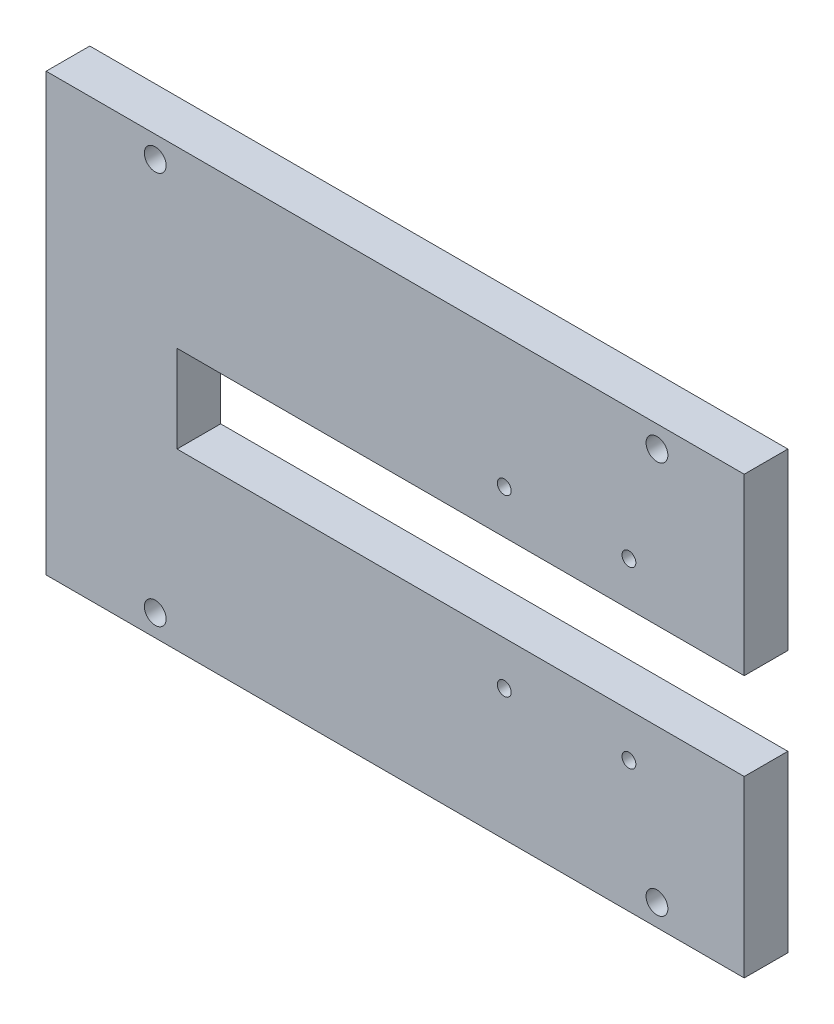
ISO-10303-21;
HEADER;
FILE_DESCRIPTION(('STEP AP214'),'2;1');
FILE_NAME('part.step','',(''),(''),'','','');
FILE_SCHEMA(('AUTOMOTIVE_DESIGN { 1 0 10303 214 1 1 1 1 }'));
ENDSEC;
DATA;
#1=APPLICATION_CONTEXT('core data for automotive mechanical design processes');
#2=APPLICATION_PROTOCOL_DEFINITION('international standard','automotive_design',2000,#1);
#3=PRODUCT_CONTEXT('',#1,'mechanical');
#4=PRODUCT('Part','Part','',(#3));
#5=PRODUCT_RELATED_PRODUCT_CATEGORY('part','',(#4));
#6=PRODUCT_DEFINITION_FORMATION('','',#4);
#7=PRODUCT_DEFINITION_CONTEXT('part definition',#1,'design');
#8=PRODUCT_DEFINITION('design','',#6,#7);
#9=PRODUCT_DEFINITION_SHAPE('','',#8);
#10=(LENGTH_UNIT() NAMED_UNIT(*) SI_UNIT(.MILLI.,.METRE.));
#11=(NAMED_UNIT(*) PLANE_ANGLE_UNIT() SI_UNIT($,.RADIAN.));
#12=(NAMED_UNIT(*) SI_UNIT($,.STERADIAN.) SOLID_ANGLE_UNIT());
#13=UNCERTAINTY_MEASURE_WITH_UNIT(LENGTH_MEASURE(1.E-05),#10,'distance_accuracy_value','');
#14=(GEOMETRIC_REPRESENTATION_CONTEXT(3) GLOBAL_UNCERTAINTY_ASSIGNED_CONTEXT((#13)) GLOBAL_UNIT_ASSIGNED_CONTEXT((#10,
#11,#12)) REPRESENTATION_CONTEXT('',''));
#15=CARTESIAN_POINT('',(0.,0.,0.));
#16=DIRECTION('',(0.,0.,1.));
#17=DIRECTION('',(1.,0.,0.));
#18=AXIS2_PLACEMENT_3D('',#15,#16,#17);
#19=CARTESIAN_POINT('',(0.,0.,10.));
#20=DIRECTION('',(0.,0.,1.));
#21=DIRECTION('',(1.,0.,0.));
#22=AXIS2_PLACEMENT_3D('',#19,#20,#21);
#23=PLANE('',#22);
#24=CARTESIAN_POINT('',(-28.5376237163047,-30.1149813348386,10.));
#25=DIRECTION('',(0.,0.,1.));
#26=DIRECTION('',(1.,0.,0.));
#27=AXIS2_PLACEMENT_3D('',#24,#25,#26);
#28=CIRCLE('',#27,2.5);
#29=CARTESIAN_POINT('',(-26.0376237163047,-30.1149813348386,10.));
#30=VERTEX_POINT('',#29);
#31=EDGE_CURVE('E211',#30,#30,#28,.T.);
#32=ORIENTED_EDGE('',*,*,#31,.F.);
#33=EDGE_LOOP('',(#32));
#34=FACE_BOUND('',#33,.T.);
#35=CARTESIAN_POINT('',(-28.5376237163047,59.8850186651614,10.));
#36=DIRECTION('',(0.,0.,1.));
#37=DIRECTION('',(1.,0.,0.));
#38=AXIS2_PLACEMENT_3D('',#35,#36,#37);
#39=CIRCLE('',#38,2.5);
#40=CARTESIAN_POINT('',(-26.0376237163047,59.8850186651614,10.));
#41=VERTEX_POINT('',#40);
#42=EDGE_CURVE('E199',#41,#41,#39,.T.);
#43=ORIENTED_EDGE('',*,*,#42,.F.);
#44=EDGE_LOOP('',(#43));
#45=FACE_BOUND('',#44,.T.);
#46=CARTESIAN_POINT('',(51.4623762836953,-5.11498133483865,10.));
#47=DIRECTION('',(0.,0.,1.));
#48=DIRECTION('',(1.,0.,0.));
#49=AXIS2_PLACEMENT_3D('',#46,#47,#48);
#50=CIRCLE('',#49,1.5875);
#51=CARTESIAN_POINT('',(53.0498762836953,-5.11498133483865,10.));
#52=VERTEX_POINT('',#51);
#53=EDGE_CURVE('E187',#52,#52,#50,.T.);
#54=ORIENTED_EDGE('',*,*,#53,.F.);
#55=EDGE_LOOP('',(#54));
#56=FACE_BOUND('',#55,.T.);
#57=CARTESIAN_POINT('',(51.4623762836953,34.8850186651615,10.));
#58=DIRECTION('',(0.,0.,1.));
#59=DIRECTION('',(1.,0.,0.));
#60=AXIS2_PLACEMENT_3D('',#57,#58,#59);
#61=CIRCLE('',#60,1.5875);
#62=CARTESIAN_POINT('',(53.0498762836953,34.8850186651615,10.));
#63=VERTEX_POINT('',#62);
#64=EDGE_CURVE('E133',#63,#63,#61,.T.);
#65=ORIENTED_EDGE('',*,*,#64,.F.);
#66=EDGE_LOOP('',(#65));
#67=FACE_BOUND('',#66,.T.);
#68=DIRECTION('',(0.,-1.,0.));
#69=VECTOR('',#68,1.);
#70=CARTESIAN_POINT('',(-53.5376237163047,64.8850186651614,10.));
#71=LINE('',#70,#69);
#72=CARTESIAN_POINT('',(-53.5376237163047,64.8850186651614,10.));
#73=VERTEX_POINT('',#72);
#74=CARTESIAN_POINT('',(-53.5376237163047,-35.1149813348386,10.));
#75=VERTEX_POINT('',#74);
#76=EDGE_CURVE('E144',#73,#75,#71,.T.);
#77=ORIENTED_EDGE('',*,*,#76,.T.);
#78=DIRECTION('',(1.,0.,0.));
#79=VECTOR('',#78,1.);
#80=CARTESIAN_POINT('',(-53.5376237163047,-35.1149813348386,10.));
#81=LINE('',#80,#79);
#82=CARTESIAN_POINT('',(106.462376283695,-35.1149813348386,10.));
#83=VERTEX_POINT('',#82);
#84=EDGE_CURVE('E92',#75,#83,#81,.T.);
#85=ORIENTED_EDGE('',*,*,#84,.T.);
#86=DIRECTION('',(0.,1.,0.));
#87=VECTOR('',#86,1.);
#88=CARTESIAN_POINT('',(106.462376283695,-35.1149813348386,10.));
#89=LINE('',#88,#87);
#90=CARTESIAN_POINT('',(106.462376283695,4.88501866516146,10.));
#91=VERTEX_POINT('',#90);
#92=EDGE_CURVE('E159',#83,#91,#89,.T.);
#93=ORIENTED_EDGE('',*,*,#92,.T.);
#94=DIRECTION('',(-1.,0.,0.));
#95=VECTOR('',#94,1.);
#96=CARTESIAN_POINT('',(106.462376283695,4.88501866516146,10.));
#97=LINE('',#96,#95);
#98=CARTESIAN_POINT('',(-23.5376237163047,4.88501866516135,10.));
#99=VERTEX_POINT('',#98);
#100=EDGE_CURVE('E172',#91,#99,#97,.T.);
#101=ORIENTED_EDGE('',*,*,#100,.T.);
#102=DIRECTION('',(0.,1.,0.));
#103=VECTOR('',#102,1.);
#104=CARTESIAN_POINT('',(-23.5376237163047,24.8850186651614,10.));
#105=LINE('',#104,#103);
#106=CARTESIAN_POINT('',(-23.5376237163047,24.8850186651614,10.));
#107=VERTEX_POINT('',#106);
#108=EDGE_CURVE('E111',#99,#107,#105,.T.);
#109=ORIENTED_EDGE('',*,*,#108,.T.);
#110=DIRECTION('',(1.,0.,0.));
#111=VECTOR('',#110,1.);
#112=CARTESIAN_POINT('',(106.462376283695,24.8850186651614,10.));
#113=LINE('',#112,#111);
#114=CARTESIAN_POINT('',(106.462376283695,24.8850186651614,10.));
#115=VERTEX_POINT('',#114);
#116=EDGE_CURVE('E105',#107,#115,#113,.T.);
#117=ORIENTED_EDGE('',*,*,#116,.T.);
#118=DIRECTION('',(0.,1.,0.));
#119=VECTOR('',#118,1.);
#120=CARTESIAN_POINT('',(106.462376283695,64.8850186651614,10.));
#121=LINE('',#120,#119);
#122=CARTESIAN_POINT('',(106.462376283695,64.8850186651614,10.));
#123=VERTEX_POINT('',#122);
#124=EDGE_CURVE('E109',#115,#123,#121,.T.);
#125=ORIENTED_EDGE('',*,*,#124,.T.);
#126=DIRECTION('',(-1.,0.,0.));
#127=VECTOR('',#126,1.);
#128=CARTESIAN_POINT('',(-53.5376237163047,64.8850186651614,10.));
#129=LINE('',#128,#127);
#130=EDGE_CURVE('E49',#123,#73,#129,.T.);
#131=ORIENTED_EDGE('',*,*,#130,.T.);
#132=EDGE_LOOP('',(#77,#85,#93,#101,#109,#117,#125,#131));
#133=FACE_BOUND('',#132,.T.);
#134=CARTESIAN_POINT('',(80.0373762836953,34.8850186651615,10.));
#135=DIRECTION('',(0.,0.,1.));
#136=DIRECTION('',(1.,0.,0.));
#137=AXIS2_PLACEMENT_3D('',#134,#135,#136);
#138=CIRCLE('',#137,1.58749999999999);
#139=CARTESIAN_POINT('',(81.6248762836952,34.8850186651615,10.));
#140=VERTEX_POINT('',#139);
#141=EDGE_CURVE('E181',#140,#140,#138,.T.);
#142=ORIENTED_EDGE('',*,*,#141,.F.);
#143=EDGE_LOOP('',(#142));
#144=FACE_BOUND('',#143,.T.);
#145=CARTESIAN_POINT('',(80.0373762836952,-5.11498133483865,10.));
#146=DIRECTION('',(0.,0.,1.));
#147=DIRECTION('',(1.,0.,0.));
#148=AXIS2_PLACEMENT_3D('',#145,#146,#147);
#149=CIRCLE('',#148,1.5875);
#150=CARTESIAN_POINT('',(81.6248762836952,-5.11498133483865,10.));
#151=VERTEX_POINT('',#150);
#152=EDGE_CURVE('E193',#151,#151,#149,.T.);
#153=ORIENTED_EDGE('',*,*,#152,.F.);
#154=EDGE_LOOP('',(#153));
#155=FACE_BOUND('',#154,.T.);
#156=CARTESIAN_POINT('',(86.4623762836953,59.8850186651614,10.));
#157=DIRECTION('',(0.,0.,1.));
#158=DIRECTION('',(1.,0.,0.));
#159=AXIS2_PLACEMENT_3D('',#156,#157,#158);
#160=CIRCLE('',#159,2.50000000000001);
#161=CARTESIAN_POINT('',(88.9623762836953,59.8850186651614,10.));
#162=VERTEX_POINT('',#161);
#163=EDGE_CURVE('E205',#162,#162,#160,.T.);
#164=ORIENTED_EDGE('',*,*,#163,.F.);
#165=EDGE_LOOP('',(#164));
#166=FACE_BOUND('',#165,.T.);
#167=CARTESIAN_POINT('',(86.4623762836953,-30.1149813348386,10.));
#168=DIRECTION('',(0.,0.,1.));
#169=DIRECTION('',(1.,0.,0.));
#170=AXIS2_PLACEMENT_3D('',#167,#168,#169);
#171=CIRCLE('',#170,2.50000000000001);
#172=CARTESIAN_POINT('',(88.9623762836953,-30.1149813348386,10.));
#173=VERTEX_POINT('',#172);
#174=EDGE_CURVE('E217',#173,#173,#171,.T.);
#175=ORIENTED_EDGE('',*,*,#174,.F.);
#176=EDGE_LOOP('',(#175));
#177=FACE_BOUND('',#176,.T.);
#178=ADVANCED_FACE('F32',(#34,#45,#56,#67,#133,#144,#155,#166,#177),#23,.T.);
#179=CARTESIAN_POINT('',(0.,0.,0.));
#180=DIRECTION('',(0.,0.,1.));
#181=DIRECTION('',(1.,0.,0.));
#182=AXIS2_PLACEMENT_3D('',#179,#180,#181);
#183=PLANE('',#182);
#184=CARTESIAN_POINT('',(-28.5376237163047,-30.1149813348386,0.));
#185=DIRECTION('',(0.,0.,1.));
#186=DIRECTION('',(1.,0.,0.));
#187=AXIS2_PLACEMENT_3D('',#184,#185,#186);
#188=CIRCLE('',#187,2.5);
#189=CARTESIAN_POINT('',(-26.0376237163047,-30.1149813348386,0.));
#190=VERTEX_POINT('',#189);
#191=EDGE_CURVE('E214',#190,#190,#188,.T.);
#192=ORIENTED_EDGE('',*,*,#191,.T.);
#193=EDGE_LOOP('',(#192));
#194=FACE_BOUND('',#193,.T.);
#195=CARTESIAN_POINT('',(-28.5376237163047,59.8850186651614,0.));
#196=DIRECTION('',(0.,0.,1.));
#197=DIRECTION('',(1.,0.,0.));
#198=AXIS2_PLACEMENT_3D('',#195,#196,#197);
#199=CIRCLE('',#198,2.5);
#200=CARTESIAN_POINT('',(-26.0376237163047,59.8850186651614,0.));
#201=VERTEX_POINT('',#200);
#202=EDGE_CURVE('E202',#201,#201,#199,.T.);
#203=ORIENTED_EDGE('',*,*,#202,.T.);
#204=EDGE_LOOP('',(#203));
#205=FACE_BOUND('',#204,.T.);
#206=CARTESIAN_POINT('',(51.4623762836953,-5.11498133483865,0.));
#207=DIRECTION('',(0.,0.,1.));
#208=DIRECTION('',(1.,0.,0.));
#209=AXIS2_PLACEMENT_3D('',#206,#207,#208);
#210=CIRCLE('',#209,1.5875);
#211=CARTESIAN_POINT('',(53.0498762836953,-5.11498133483865,0.));
#212=VERTEX_POINT('',#211);
#213=EDGE_CURVE('E190',#212,#212,#210,.T.);
#214=ORIENTED_EDGE('',*,*,#213,.T.);
#215=EDGE_LOOP('',(#214));
#216=FACE_BOUND('',#215,.T.);
#217=CARTESIAN_POINT('',(51.4623762836953,34.8850186651615,0.));
#218=DIRECTION('',(0.,0.,1.));
#219=DIRECTION('',(1.,0.,0.));
#220=AXIS2_PLACEMENT_3D('',#217,#218,#219);
#221=CIRCLE('',#220,1.5875);
#222=CARTESIAN_POINT('',(53.0498762836953,34.8850186651615,0.));
#223=VERTEX_POINT('',#222);
#224=EDGE_CURVE('E178',#223,#223,#221,.T.);
#225=ORIENTED_EDGE('',*,*,#224,.T.);
#226=EDGE_LOOP('',(#225));
#227=FACE_BOUND('',#226,.T.);
#228=DIRECTION('',(0.,-1.,0.));
#229=VECTOR('',#228,1.);
#230=CARTESIAN_POINT('',(-53.5376237163047,64.8850186651614,0.));
#231=LINE('',#230,#229);
#232=CARTESIAN_POINT('',(-53.5376237163047,64.8850186651614,0.));
#233=VERTEX_POINT('',#232);
#234=CARTESIAN_POINT('',(-53.5376237163047,-35.1149813348386,0.));
#235=VERTEX_POINT('',#234);
#236=EDGE_CURVE('E129',#233,#235,#231,.T.);
#237=ORIENTED_EDGE('',*,*,#236,.F.);
#238=DIRECTION('',(-1.,0.,0.));
#239=VECTOR('',#238,1.);
#240=CARTESIAN_POINT('',(-53.5376237163047,64.8850186651614,0.));
#241=LINE('',#240,#239);
#242=CARTESIAN_POINT('',(106.462376283695,64.8850186651614,0.));
#243=VERTEX_POINT('',#242);
#244=EDGE_CURVE('E84',#243,#233,#241,.T.);
#245=ORIENTED_EDGE('',*,*,#244,.F.);
#246=DIRECTION('',(0.,1.,0.));
#247=VECTOR('',#246,1.);
#248=CARTESIAN_POINT('',(106.462376283695,64.8850186651614,0.));
#249=LINE('',#248,#247);
#250=CARTESIAN_POINT('',(106.462376283695,24.8850186651614,0.));
#251=VERTEX_POINT('',#250);
#252=EDGE_CURVE('E78',#251,#243,#249,.T.);
#253=ORIENTED_EDGE('',*,*,#252,.F.);
#254=DIRECTION('',(1.,0.,0.));
#255=VECTOR('',#254,1.);
#256=CARTESIAN_POINT('',(106.462376283695,24.8850186651614,0.));
#257=LINE('',#256,#255);
#258=CARTESIAN_POINT('',(-23.5376237163047,24.8850186651614,0.));
#259=VERTEX_POINT('',#258);
#260=EDGE_CURVE('E119',#259,#251,#257,.T.);
#261=ORIENTED_EDGE('',*,*,#260,.F.);
#262=DIRECTION('',(0.,1.,0.));
#263=VECTOR('',#262,1.);
#264=CARTESIAN_POINT('',(-23.5376237163047,24.8850186651614,0.));
#265=LINE('',#264,#263);
#266=CARTESIAN_POINT('',(-23.5376237163047,4.88501866516135,0.));
#267=VERTEX_POINT('',#266);
#268=EDGE_CURVE('E139',#267,#259,#265,.T.);
#269=ORIENTED_EDGE('',*,*,#268,.F.);
#270=DIRECTION('',(-1.,0.,0.));
#271=VECTOR('',#270,1.);
#272=CARTESIAN_POINT('',(106.462376283695,4.88501866516146,0.));
#273=LINE('',#272,#271);
#274=CARTESIAN_POINT('',(106.462376283695,4.88501866516146,0.));
#275=VERTEX_POINT('',#274);
#276=EDGE_CURVE('E137',#275,#267,#273,.T.);
#277=ORIENTED_EDGE('',*,*,#276,.F.);
#278=DIRECTION('',(0.,1.,0.));
#279=VECTOR('',#278,1.);
#280=CARTESIAN_POINT('',(106.462376283695,-35.1149813348386,0.));
#281=LINE('',#280,#279);
#282=CARTESIAN_POINT('',(106.462376283695,-35.1149813348386,0.));
#283=VERTEX_POINT('',#282);
#284=EDGE_CURVE('E135',#283,#275,#281,.T.);
#285=ORIENTED_EDGE('',*,*,#284,.F.);
#286=DIRECTION('',(1.,0.,0.));
#287=VECTOR('',#286,1.);
#288=CARTESIAN_POINT('',(-53.5376237163047,-35.1149813348386,0.));
#289=LINE('',#288,#287);
#290=EDGE_CURVE('E132',#235,#283,#289,.T.);
#291=ORIENTED_EDGE('',*,*,#290,.F.);
#292=EDGE_LOOP('',(#237,#245,#253,#261,#269,#277,#285,#291));
#293=FACE_BOUND('',#292,.T.);
#294=CARTESIAN_POINT('',(80.0373762836953,34.8850186651615,0.));
#295=DIRECTION('',(0.,0.,1.));
#296=DIRECTION('',(1.,0.,0.));
#297=AXIS2_PLACEMENT_3D('',#294,#295,#296);
#298=CIRCLE('',#297,1.58749999999999);
#299=CARTESIAN_POINT('',(81.6248762836952,34.8850186651615,0.));
#300=VERTEX_POINT('',#299);
#301=EDGE_CURVE('E184',#300,#300,#298,.T.);
#302=ORIENTED_EDGE('',*,*,#301,.T.);
#303=EDGE_LOOP('',(#302));
#304=FACE_BOUND('',#303,.T.);
#305=CARTESIAN_POINT('',(80.0373762836952,-5.11498133483865,0.));
#306=DIRECTION('',(0.,0.,1.));
#307=DIRECTION('',(1.,0.,0.));
#308=AXIS2_PLACEMENT_3D('',#305,#306,#307);
#309=CIRCLE('',#308,1.5875);
#310=CARTESIAN_POINT('',(81.6248762836952,-5.11498133483865,0.));
#311=VERTEX_POINT('',#310);
#312=EDGE_CURVE('E196',#311,#311,#309,.T.);
#313=ORIENTED_EDGE('',*,*,#312,.T.);
#314=EDGE_LOOP('',(#313));
#315=FACE_BOUND('',#314,.T.);
#316=CARTESIAN_POINT('',(86.4623762836953,59.8850186651614,0.));
#317=DIRECTION('',(0.,0.,1.));
#318=DIRECTION('',(1.,0.,0.));
#319=AXIS2_PLACEMENT_3D('',#316,#317,#318);
#320=CIRCLE('',#319,2.50000000000001);
#321=CARTESIAN_POINT('',(88.9623762836953,59.8850186651614,0.));
#322=VERTEX_POINT('',#321);
#323=EDGE_CURVE('E208',#322,#322,#320,.T.);
#324=ORIENTED_EDGE('',*,*,#323,.T.);
#325=EDGE_LOOP('',(#324));
#326=FACE_BOUND('',#325,.T.);
#327=CARTESIAN_POINT('',(86.4623762836953,-30.1149813348386,0.));
#328=DIRECTION('',(0.,0.,1.));
#329=DIRECTION('',(1.,0.,0.));
#330=AXIS2_PLACEMENT_3D('',#327,#328,#329);
#331=CIRCLE('',#330,2.50000000000001);
#332=CARTESIAN_POINT('',(88.9623762836953,-30.1149813348386,0.));
#333=VERTEX_POINT('',#332);
#334=EDGE_CURVE('E220',#333,#333,#331,.T.);
#335=ORIENTED_EDGE('',*,*,#334,.T.);
#336=EDGE_LOOP('',(#335));
#337=FACE_BOUND('',#336,.T.);
#338=ADVANCED_FACE('F163',(#194,#205,#216,#227,#293,#304,#315,#326,#337),#183,.F.);
#339=CARTESIAN_POINT('',(-53.5376237163047,64.8850186651614,10.));
#340=DIRECTION('',(1.,0.,0.));
#341=DIRECTION('',(0.,1.,0.));
#342=AXIS2_PLACEMENT_3D('',#339,#340,#341);
#343=PLANE('',#342);
#344=ORIENTED_EDGE('',*,*,#236,.T.);
#345=DIRECTION('',(0.,0.,-1.));
#346=VECTOR('',#345,1.);
#347=CARTESIAN_POINT('',(-53.5376237163047,-35.1149813348386,10.));
#348=LINE('',#347,#346);
#349=EDGE_CURVE('E11',#75,#235,#348,.T.);
#350=ORIENTED_EDGE('',*,*,#349,.F.);
#351=ORIENTED_EDGE('',*,*,#76,.F.);
#352=DIRECTION('',(0.,0.,-1.));
#353=VECTOR('',#352,1.);
#354=CARTESIAN_POINT('',(-53.5376237163047,64.8850186651614,10.));
#355=LINE('',#354,#353);
#356=EDGE_CURVE('E125',#73,#233,#355,.T.);
#357=ORIENTED_EDGE('',*,*,#356,.T.);
#358=EDGE_LOOP('',(#344,#350,#351,#357));
#359=FACE_BOUND('',#358,.T.);
#360=ADVANCED_FACE('F34',(#359),#343,.F.);
#361=CARTESIAN_POINT('',(-53.5376237163047,-35.1149813348386,10.));
#362=DIRECTION('',(0.,1.,0.));
#363=DIRECTION('',(-1.,0.,0.));
#364=AXIS2_PLACEMENT_3D('',#361,#362,#363);
#365=PLANE('',#364);
#366=ORIENTED_EDGE('',*,*,#290,.T.);
#367=DIRECTION('',(0.,0.,-1.));
#368=VECTOR('',#367,1.);
#369=CARTESIAN_POINT('',(106.462376283695,-35.1149813348386,10.));
#370=LINE('',#369,#368);
#371=EDGE_CURVE('E41',#83,#283,#370,.T.);
#372=ORIENTED_EDGE('',*,*,#371,.F.);
#373=ORIENTED_EDGE('',*,*,#84,.F.);
#374=ORIENTED_EDGE('',*,*,#349,.T.);
#375=EDGE_LOOP('',(#366,#372,#373,#374));
#376=FACE_BOUND('',#375,.T.);
#377=ADVANCED_FACE('F255',(#376),#365,.F.);
#378=CARTESIAN_POINT('',(106.462376283695,-35.1149813348386,10.));
#379=DIRECTION('',(-1.,0.,0.));
#380=DIRECTION('',(0.,0.,1.));
#381=AXIS2_PLACEMENT_3D('',#378,#379,#380);
#382=PLANE('',#381);
#383=ORIENTED_EDGE('',*,*,#284,.T.);
#384=DIRECTION('',(0.,0.,-1.));
#385=VECTOR('',#384,1.);
#386=CARTESIAN_POINT('',(106.462376283695,4.88501866516146,10.));
#387=LINE('',#386,#385);
#388=EDGE_CURVE('E151',#91,#275,#387,.T.);
#389=ORIENTED_EDGE('',*,*,#388,.F.);
#390=ORIENTED_EDGE('',*,*,#92,.F.);
#391=ORIENTED_EDGE('',*,*,#371,.T.);
#392=EDGE_LOOP('',(#383,#389,#390,#391));
#393=FACE_BOUND('',#392,.T.);
#394=ADVANCED_FACE('F157',(#393),#382,.F.);
#395=CARTESIAN_POINT('',(106.462376283695,4.88501866516146,10.));
#396=DIRECTION('',(0.,-1.,0.));
#397=DIRECTION('',(1.,0.,0.));
#398=AXIS2_PLACEMENT_3D('',#395,#396,#397);
#399=PLANE('',#398);
#400=ORIENTED_EDGE('',*,*,#276,.T.);
#401=DIRECTION('',(0.,0.,-1.));
#402=VECTOR('',#401,1.);
#403=CARTESIAN_POINT('',(-23.5376237163047,4.88501866516135,10.));
#404=LINE('',#403,#402);
#405=EDGE_CURVE('E148',#99,#267,#404,.T.);
#406=ORIENTED_EDGE('',*,*,#405,.F.);
#407=ORIENTED_EDGE('',*,*,#100,.F.);
#408=ORIENTED_EDGE('',*,*,#388,.T.);
#409=EDGE_LOOP('',(#400,#406,#407,#408));
#410=FACE_BOUND('',#409,.T.);
#411=ADVANCED_FACE('F168',(#410),#399,.F.);
#412=CARTESIAN_POINT('',(-23.5376237163047,24.8850186651614,10.));
#413=DIRECTION('',(-1.,0.,0.));
#414=DIRECTION('',(0.,0.,1.));
#415=AXIS2_PLACEMENT_3D('',#412,#413,#414);
#416=PLANE('',#415);
#417=ORIENTED_EDGE('',*,*,#268,.T.);
#418=DIRECTION('',(0.,0.,-1.));
#419=VECTOR('',#418,1.);
#420=CARTESIAN_POINT('',(-23.5376237163047,24.8850186651614,10.));
#421=LINE('',#420,#419);
#422=EDGE_CURVE('E120',#107,#259,#421,.T.);
#423=ORIENTED_EDGE('',*,*,#422,.F.);
#424=ORIENTED_EDGE('',*,*,#108,.F.);
#425=ORIENTED_EDGE('',*,*,#405,.T.);
#426=EDGE_LOOP('',(#417,#423,#424,#425));
#427=FACE_BOUND('',#426,.T.);
#428=ADVANCED_FACE('F171',(#427),#416,.F.);
#429=CARTESIAN_POINT('',(106.462376283695,24.8850186651614,10.));
#430=DIRECTION('',(0.,1.,0.));
#431=DIRECTION('',(0.,0.,1.));
#432=AXIS2_PLACEMENT_3D('',#429,#430,#431);
#433=PLANE('',#432);
#434=ORIENTED_EDGE('',*,*,#260,.T.);
#435=DIRECTION('',(0.,0.,-1.));
#436=VECTOR('',#435,1.);
#437=CARTESIAN_POINT('',(106.462376283695,24.8850186651614,10.));
#438=LINE('',#437,#436);
#439=EDGE_CURVE('E116',#115,#251,#438,.T.);
#440=ORIENTED_EDGE('',*,*,#439,.F.);
#441=ORIENTED_EDGE('',*,*,#116,.F.);
#442=ORIENTED_EDGE('',*,*,#422,.T.);
#443=EDGE_LOOP('',(#434,#440,#441,#442));
#444=FACE_BOUND('',#443,.T.);
#445=ADVANCED_FACE('F117',(#444),#433,.F.);
#446=CARTESIAN_POINT('',(106.462376283695,64.8850186651614,10.));
#447=DIRECTION('',(-1.,0.,0.));
#448=DIRECTION('',(0.,0.,1.));
#449=AXIS2_PLACEMENT_3D('',#446,#447,#448);
#450=PLANE('',#449);
#451=ORIENTED_EDGE('',*,*,#252,.T.);
#452=DIRECTION('',(0.,0.,-1.));
#453=VECTOR('',#452,1.);
#454=CARTESIAN_POINT('',(106.462376283695,64.8850186651614,10.));
#455=LINE('',#454,#453);
#456=EDGE_CURVE('E121',#123,#243,#455,.T.);
#457=ORIENTED_EDGE('',*,*,#456,.F.);
#458=ORIENTED_EDGE('',*,*,#124,.F.);
#459=ORIENTED_EDGE('',*,*,#439,.T.);
#460=EDGE_LOOP('',(#451,#457,#458,#459));
#461=FACE_BOUND('',#460,.T.);
#462=ADVANCED_FACE('F123',(#461),#450,.F.);
#463=CARTESIAN_POINT('',(-53.5376237163047,64.8850186651614,10.));
#464=DIRECTION('',(0.,-1.,0.));
#465=DIRECTION('',(1.,0.,0.));
#466=AXIS2_PLACEMENT_3D('',#463,#464,#465);
#467=PLANE('',#466);
#468=ORIENTED_EDGE('',*,*,#244,.T.);
#469=ORIENTED_EDGE('',*,*,#356,.F.);
#470=ORIENTED_EDGE('',*,*,#130,.F.);
#471=ORIENTED_EDGE('',*,*,#456,.T.);
#472=EDGE_LOOP('',(#468,#469,#470,#471));
#473=FACE_BOUND('',#472,.T.);
#474=ADVANCED_FACE('F243',(#473),#467,.F.);
#475=CARTESIAN_POINT('',(51.4623762836953,34.8850186651615,10.));
#476=DIRECTION('',(0.,0.,-1.));
#477=DIRECTION('',(-1.,0.,0.));
#478=AXIS2_PLACEMENT_3D('',#475,#476,#477);
#479=CYLINDRICAL_SURFACE('',#478,1.5875);
#480=ORIENTED_EDGE('',*,*,#64,.T.);
#481=EDGE_LOOP('',(#480));
#482=FACE_BOUND('',#481,.T.);
#483=ORIENTED_EDGE('',*,*,#224,.F.);
#484=EDGE_LOOP('',(#483));
#485=FACE_BOUND('',#484,.T.);
#486=ADVANCED_FACE('F240',(#482,#485),#479,.F.);
#487=CARTESIAN_POINT('',(80.0373762836953,34.8850186651615,10.));
#488=DIRECTION('',(0.,0.,-1.));
#489=DIRECTION('',(-1.,0.,0.));
#490=AXIS2_PLACEMENT_3D('',#487,#488,#489);
#491=CYLINDRICAL_SURFACE('',#490,1.58749999999999);
#492=ORIENTED_EDGE('',*,*,#141,.T.);
#493=EDGE_LOOP('',(#492));
#494=FACE_BOUND('',#493,.T.);
#495=ORIENTED_EDGE('',*,*,#301,.F.);
#496=EDGE_LOOP('',(#495));
#497=FACE_BOUND('',#496,.T.);
#498=ADVANCED_FACE('F319',(#494,#497),#491,.F.);
#499=CARTESIAN_POINT('',(51.4623762836953,-5.11498133483865,10.));
#500=DIRECTION('',(0.,0.,-1.));
#501=DIRECTION('',(-1.,0.,0.));
#502=AXIS2_PLACEMENT_3D('',#499,#500,#501);
#503=CYLINDRICAL_SURFACE('',#502,1.5875);
#504=ORIENTED_EDGE('',*,*,#53,.T.);
#505=EDGE_LOOP('',(#504));
#506=FACE_BOUND('',#505,.T.);
#507=ORIENTED_EDGE('',*,*,#213,.F.);
#508=EDGE_LOOP('',(#507));
#509=FACE_BOUND('',#508,.T.);
#510=ADVANCED_FACE('F327',(#506,#509),#503,.F.);
#511=CARTESIAN_POINT('',(80.0373762836952,-5.11498133483865,10.));
#512=DIRECTION('',(0.,0.,-1.));
#513=DIRECTION('',(-1.,0.,0.));
#514=AXIS2_PLACEMENT_3D('',#511,#512,#513);
#515=CYLINDRICAL_SURFACE('',#514,1.5875);
#516=ORIENTED_EDGE('',*,*,#152,.T.);
#517=EDGE_LOOP('',(#516));
#518=FACE_BOUND('',#517,.T.);
#519=ORIENTED_EDGE('',*,*,#312,.F.);
#520=EDGE_LOOP('',(#519));
#521=FACE_BOUND('',#520,.T.);
#522=ADVANCED_FACE('F335',(#518,#521),#515,.F.);
#523=CARTESIAN_POINT('',(-28.5376237163047,59.8850186651614,10.));
#524=DIRECTION('',(0.,0.,-1.));
#525=DIRECTION('',(-1.,0.,0.));
#526=AXIS2_PLACEMENT_3D('',#523,#524,#525);
#527=CYLINDRICAL_SURFACE('',#526,2.5);
#528=ORIENTED_EDGE('',*,*,#42,.T.);
#529=EDGE_LOOP('',(#528));
#530=FACE_BOUND('',#529,.T.);
#531=ORIENTED_EDGE('',*,*,#202,.F.);
#532=EDGE_LOOP('',(#531));
#533=FACE_BOUND('',#532,.T.);
#534=ADVANCED_FACE('F344',(#530,#533),#527,.F.);
#535=CARTESIAN_POINT('',(86.4623762836953,59.8850186651614,10.));
#536=DIRECTION('',(0.,0.,-1.));
#537=DIRECTION('',(-1.,0.,0.));
#538=AXIS2_PLACEMENT_3D('',#535,#536,#537);
#539=CYLINDRICAL_SURFACE('',#538,2.50000000000001);
#540=ORIENTED_EDGE('',*,*,#163,.T.);
#541=EDGE_LOOP('',(#540));
#542=FACE_BOUND('',#541,.T.);
#543=ORIENTED_EDGE('',*,*,#323,.F.);
#544=EDGE_LOOP('',(#543));
#545=FACE_BOUND('',#544,.T.);
#546=ADVANCED_FACE('F353',(#542,#545),#539,.F.);
#547=CARTESIAN_POINT('',(-28.5376237163047,-30.1149813348386,10.));
#548=DIRECTION('',(0.,0.,-1.));
#549=DIRECTION('',(-1.,0.,0.));
#550=AXIS2_PLACEMENT_3D('',#547,#548,#549);
#551=CYLINDRICAL_SURFACE('',#550,2.5);
#552=ORIENTED_EDGE('',*,*,#31,.T.);
#553=EDGE_LOOP('',(#552));
#554=FACE_BOUND('',#553,.T.);
#555=ORIENTED_EDGE('',*,*,#191,.F.);
#556=EDGE_LOOP('',(#555));
#557=FACE_BOUND('',#556,.T.);
#558=ADVANCED_FACE('F362',(#554,#557),#551,.F.);
#559=CARTESIAN_POINT('',(86.4623762836953,-30.1149813348386,10.));
#560=DIRECTION('',(0.,0.,-1.));
#561=DIRECTION('',(-1.,0.,0.));
#562=AXIS2_PLACEMENT_3D('',#559,#560,#561);
#563=CYLINDRICAL_SURFACE('',#562,2.50000000000001);
#564=ORIENTED_EDGE('',*,*,#174,.T.);
#565=EDGE_LOOP('',(#564));
#566=FACE_BOUND('',#565,.T.);
#567=ORIENTED_EDGE('',*,*,#334,.F.);
#568=EDGE_LOOP('',(#567));
#569=FACE_BOUND('',#568,.T.);
#570=ADVANCED_FACE('F226',(#566,#569),#563,.F.);
#571=CLOSED_SHELL('',(#178,#338,#360,#377,#394,#411,#428,#445,#462,#474,#486,#498,#510,#522,
#534,#546,#558,#570));
#572=MANIFOLD_SOLID_BREP('B2',#571);
#573=ADVANCED_BREP_SHAPE_REPRESENTATION('',(#18,#572),#14);
#574=SHAPE_DEFINITION_REPRESENTATION(#9,#573);
ENDSEC;
END-ISO-10303-21;
